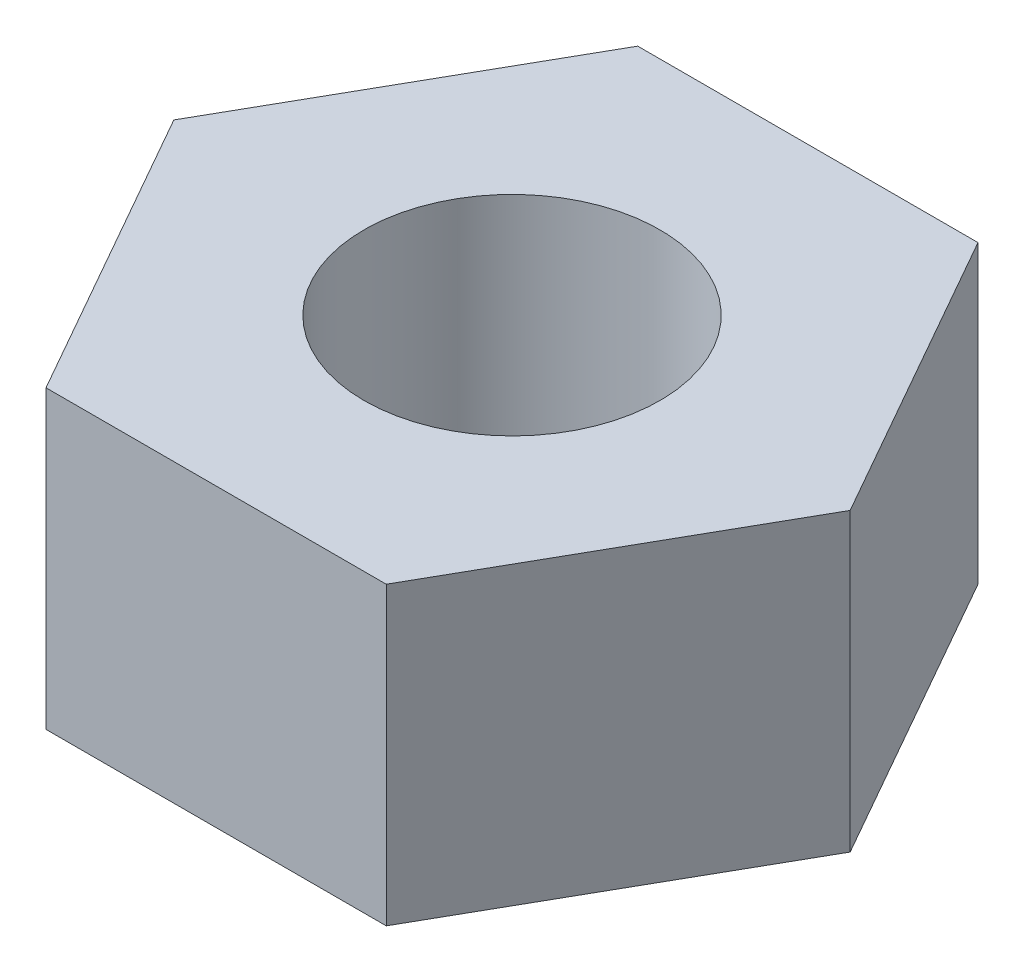
ISO-10303-21;
HEADER;
FILE_DESCRIPTION(('STEP AP214'),'2;1');
FILE_NAME('part.step','',(''),(''),'','','');
FILE_SCHEMA(('AUTOMOTIVE_DESIGN { 1 0 10303 214 1 1 1 1 }'));
ENDSEC;
DATA;
#1=APPLICATION_CONTEXT('core data for automotive mechanical design processes');
#2=APPLICATION_PROTOCOL_DEFINITION('international standard','automotive_design',2000,#1);
#3=PRODUCT_CONTEXT('',#1,'mechanical');
#4=PRODUCT('Part','Part','',(#3));
#5=PRODUCT_RELATED_PRODUCT_CATEGORY('part','',(#4));
#6=PRODUCT_DEFINITION_FORMATION('','',#4);
#7=PRODUCT_DEFINITION_CONTEXT('part definition',#1,'design');
#8=PRODUCT_DEFINITION('design','',#6,#7);
#9=PRODUCT_DEFINITION_SHAPE('','',#8);
#10=(LENGTH_UNIT() NAMED_UNIT(*) SI_UNIT(.MILLI.,.METRE.));
#11=(NAMED_UNIT(*) PLANE_ANGLE_UNIT() SI_UNIT($,.RADIAN.));
#12=(NAMED_UNIT(*) SI_UNIT($,.STERADIAN.) SOLID_ANGLE_UNIT());
#13=UNCERTAINTY_MEASURE_WITH_UNIT(LENGTH_MEASURE(1.E-05),#10,'distance_accuracy_value','');
#14=(GEOMETRIC_REPRESENTATION_CONTEXT(3) GLOBAL_UNCERTAINTY_ASSIGNED_CONTEXT((#13)) GLOBAL_UNIT_ASSIGNED_CONTEXT((#10,
#11,#12)) REPRESENTATION_CONTEXT('',''));
#15=CARTESIAN_POINT('',(0.,0.,0.));
#16=DIRECTION('',(0.,0.,1.));
#17=DIRECTION('',(1.,0.,0.));
#18=AXIS2_PLACEMENT_3D('',#15,#16,#17);
#19=CARTESIAN_POINT('',(0.,10.,0.));
#20=DIRECTION('',(0.,-1.,0.));
#21=DIRECTION('',(0.,0.,-1.));
#22=AXIS2_PLACEMENT_3D('',#19,#20,#21);
#23=PLANE('',#22);
#24=DIRECTION('',(-0.493818117026111,0.,0.869565217391304));
#25=VECTOR('',#24,1.);
#26=CARTESIAN_POINT('',(-11.4289083458003,10.,0.));
#27=LINE('',#26,#25);
#28=CARTESIAN_POINT('',(-5.75,10.,-10.));
#29=VERTEX_POINT('',#28);
#30=CARTESIAN_POINT('',(-11.4289083458003,10.,0.));
#31=VERTEX_POINT('',#30);
#32=EDGE_CURVE('E150',#29,#31,#27,.T.);
#33=ORIENTED_EDGE('',*,*,#32,.T.);
#34=DIRECTION('',(0.493818117026111,0.,0.869565217391304));
#35=VECTOR('',#34,1.);
#36=CARTESIAN_POINT('',(-5.75,10.,10.));
#37=LINE('',#36,#35);
#38=CARTESIAN_POINT('',(-5.75,10.,10.));
#39=VERTEX_POINT('',#38);
#40=EDGE_CURVE('E98',#31,#39,#37,.T.);
#41=ORIENTED_EDGE('',*,*,#40,.T.);
#42=DIRECTION('',(1.,0.,0.));
#43=VECTOR('',#42,1.);
#44=CARTESIAN_POINT('',(5.75,10.,10.));
#45=LINE('',#44,#43);
#46=CARTESIAN_POINT('',(5.75,10.,10.));
#47=VERTEX_POINT('',#46);
#48=EDGE_CURVE('E111',#39,#47,#45,.T.);
#49=ORIENTED_EDGE('',*,*,#48,.T.);
#50=DIRECTION('',(0.493818117026111,0.,-0.869565217391304));
#51=VECTOR('',#50,1.);
#52=CARTESIAN_POINT('',(11.4289083458003,10.,0.));
#53=LINE('',#52,#51);
#54=CARTESIAN_POINT('',(11.4289083458003,10.,0.));
#55=VERTEX_POINT('',#54);
#56=EDGE_CURVE('E105',#47,#55,#53,.T.);
#57=ORIENTED_EDGE('',*,*,#56,.T.);
#58=DIRECTION('',(-0.493818117026111,0.,-0.869565217391304));
#59=VECTOR('',#58,1.);
#60=CARTESIAN_POINT('',(5.75,10.,-10.));
#61=LINE('',#60,#59);
#62=CARTESIAN_POINT('',(5.75,10.,-10.));
#63=VERTEX_POINT('',#62);
#64=EDGE_CURVE('E109',#55,#63,#61,.T.);
#65=ORIENTED_EDGE('',*,*,#64,.T.);
#66=DIRECTION('',(-1.,0.,0.));
#67=VECTOR('',#66,1.);
#68=CARTESIAN_POINT('',(-5.75,10.,-10.));
#69=LINE('',#68,#67);
#70=EDGE_CURVE('E61',#63,#29,#69,.T.);
#71=ORIENTED_EDGE('',*,*,#70,.T.);
#72=EDGE_LOOP('',(#33,#41,#49,#57,#65,#71));
#73=FACE_BOUND('',#72,.T.);
#74=CARTESIAN_POINT('',(0.,10.,0.));
#75=DIRECTION('',(0.,1.,0.));
#76=DIRECTION('',(0.,0.,1.));
#77=AXIS2_PLACEMENT_3D('',#74,#75,#76);
#78=CIRCLE('',#77,5.);
#79=CARTESIAN_POINT('',(0.,10.,5.));
#80=VERTEX_POINT('',#79);
#81=EDGE_CURVE('E138',#80,#80,#78,.T.);
#82=ORIENTED_EDGE('',*,*,#81,.F.);
#83=EDGE_LOOP('',(#82));
#84=FACE_BOUND('',#83,.T.);
#85=ADVANCED_FACE('F43',(#73,#84),#23,.F.);
#86=CARTESIAN_POINT('',(0.,0.,0.));
#87=DIRECTION('',(0.,-1.,0.));
#88=DIRECTION('',(0.,0.,-1.));
#89=AXIS2_PLACEMENT_3D('',#86,#87,#88);
#90=PLANE('',#89);
#91=DIRECTION('',(-0.493818117026111,0.,0.869565217391304));
#92=VECTOR('',#91,1.);
#93=CARTESIAN_POINT('',(-11.4289083458003,0.,0.));
#94=LINE('',#93,#92);
#95=CARTESIAN_POINT('',(-5.75,0.,-10.));
#96=VERTEX_POINT('',#95);
#97=CARTESIAN_POINT('',(-11.4289083458003,0.,0.));
#98=VERTEX_POINT('',#97);
#99=EDGE_CURVE('E133',#96,#98,#94,.T.);
#100=ORIENTED_EDGE('',*,*,#99,.F.);
#101=DIRECTION('',(-1.,0.,0.));
#102=VECTOR('',#101,1.);
#103=CARTESIAN_POINT('',(-5.75,0.,-10.));
#104=LINE('',#103,#102);
#105=CARTESIAN_POINT('',(5.75,0.,-10.));
#106=VERTEX_POINT('',#105);
#107=EDGE_CURVE('E90',#106,#96,#104,.T.);
#108=ORIENTED_EDGE('',*,*,#107,.F.);
#109=DIRECTION('',(-0.493818117026111,0.,-0.869565217391304));
#110=VECTOR('',#109,1.);
#111=CARTESIAN_POINT('',(5.75,0.,-10.));
#112=LINE('',#111,#110);
#113=CARTESIAN_POINT('',(11.4289083458003,0.,0.));
#114=VERTEX_POINT('',#113);
#115=EDGE_CURVE('E84',#114,#106,#112,.T.);
#116=ORIENTED_EDGE('',*,*,#115,.F.);
#117=DIRECTION('',(0.493818117026111,0.,-0.869565217391304));
#118=VECTOR('',#117,1.);
#119=CARTESIAN_POINT('',(11.4289083458003,0.,0.));
#120=LINE('',#119,#118);
#121=CARTESIAN_POINT('',(5.75,0.,10.));
#122=VERTEX_POINT('',#121);
#123=EDGE_CURVE('E120',#122,#114,#120,.T.);
#124=ORIENTED_EDGE('',*,*,#123,.F.);
#125=DIRECTION('',(1.,0.,0.));
#126=VECTOR('',#125,1.);
#127=CARTESIAN_POINT('',(5.75,0.,10.));
#128=LINE('',#127,#126);
#129=CARTESIAN_POINT('',(-5.75,0.,10.));
#130=VERTEX_POINT('',#129);
#131=EDGE_CURVE('E141',#130,#122,#128,.T.);
#132=ORIENTED_EDGE('',*,*,#131,.F.);
#133=DIRECTION('',(0.493818117026111,0.,0.869565217391304));
#134=VECTOR('',#133,1.);
#135=CARTESIAN_POINT('',(-5.75,0.,10.));
#136=LINE('',#135,#134);
#137=EDGE_CURVE('E137',#98,#130,#136,.T.);
#138=ORIENTED_EDGE('',*,*,#137,.F.);
#139=EDGE_LOOP('',(#100,#108,#116,#124,#132,#138));
#140=FACE_BOUND('',#139,.T.);
#141=CARTESIAN_POINT('',(0.,0.,0.));
#142=DIRECTION('',(0.,1.,0.));
#143=DIRECTION('',(0.,0.,1.));
#144=AXIS2_PLACEMENT_3D('',#141,#142,#143);
#145=CIRCLE('',#144,5.);
#146=CARTESIAN_POINT('',(0.,0.,5.));
#147=VERTEX_POINT('',#146);
#148=EDGE_CURVE('E265',#147,#147,#145,.T.);
#149=ORIENTED_EDGE('',*,*,#148,.T.);
#150=EDGE_LOOP('',(#149));
#151=FACE_BOUND('',#150,.T.);
#152=ADVANCED_FACE('F163',(#140,#151),#90,.T.);
#153=CARTESIAN_POINT('',(-11.4289083458003,10.,0.));
#154=DIRECTION('',(0.869565217391304,0.,0.493818117026111));
#155=DIRECTION('',(0.493818117026111,0.,-0.869565217391304));
#156=AXIS2_PLACEMENT_3D('',#153,#154,#155);
#157=PLANE('',#156);
#158=ORIENTED_EDGE('',*,*,#99,.T.);
#159=DIRECTION('',(0.,-1.,0.));
#160=VECTOR('',#159,1.);
#161=CARTESIAN_POINT('',(-11.4289083458003,10.,0.));
#162=LINE('',#161,#160);
#163=EDGE_CURVE('E11',#31,#98,#162,.T.);
#164=ORIENTED_EDGE('',*,*,#163,.F.);
#165=ORIENTED_EDGE('',*,*,#32,.F.);
#166=DIRECTION('',(0.,-1.,0.));
#167=VECTOR('',#166,1.);
#168=CARTESIAN_POINT('',(-5.75,10.,-10.));
#169=LINE('',#168,#167);
#170=EDGE_CURVE('E129',#29,#96,#169,.T.);
#171=ORIENTED_EDGE('',*,*,#170,.T.);
#172=EDGE_LOOP('',(#158,#164,#165,#171));
#173=FACE_BOUND('',#172,.T.);
#174=ADVANCED_FACE('F45',(#173),#157,.F.);
#175=CARTESIAN_POINT('',(-5.75,10.,10.));
#176=DIRECTION('',(0.869565217391304,0.,-0.493818117026111));
#177=DIRECTION('',(-0.493818117026111,0.,-0.869565217391304));
#178=AXIS2_PLACEMENT_3D('',#175,#176,#177);
#179=PLANE('',#178);
#180=ORIENTED_EDGE('',*,*,#137,.T.);
#181=DIRECTION('',(0.,-1.,0.));
#182=VECTOR('',#181,1.);
#183=CARTESIAN_POINT('',(-5.75,10.,10.));
#184=LINE('',#183,#182);
#185=EDGE_CURVE('E53',#39,#130,#184,.T.);
#186=ORIENTED_EDGE('',*,*,#185,.F.);
#187=ORIENTED_EDGE('',*,*,#40,.F.);
#188=ORIENTED_EDGE('',*,*,#163,.T.);
#189=EDGE_LOOP('',(#180,#186,#187,#188));
#190=FACE_BOUND('',#189,.T.);
#191=ADVANCED_FACE('F188',(#190),#179,.F.);
#192=CARTESIAN_POINT('',(5.75,10.,10.));
#193=DIRECTION('',(0.,0.,-1.));
#194=DIRECTION('',(-1.,0.,0.));
#195=AXIS2_PLACEMENT_3D('',#192,#193,#194);
#196=PLANE('',#195);
#197=ORIENTED_EDGE('',*,*,#131,.T.);
#198=DIRECTION('',(0.,-1.,0.));
#199=VECTOR('',#198,1.);
#200=CARTESIAN_POINT('',(5.75,10.,10.));
#201=LINE('',#200,#199);
#202=EDGE_CURVE('E122',#47,#122,#201,.T.);
#203=ORIENTED_EDGE('',*,*,#202,.F.);
#204=ORIENTED_EDGE('',*,*,#48,.F.);
#205=ORIENTED_EDGE('',*,*,#185,.T.);
#206=EDGE_LOOP('',(#197,#203,#204,#205));
#207=FACE_BOUND('',#206,.T.);
#208=ADVANCED_FACE('F160',(#207),#196,.F.);
#209=CARTESIAN_POINT('',(11.4289083458003,10.,0.));
#210=DIRECTION('',(-0.869565217391304,0.,-0.493818117026111));
#211=DIRECTION('',(-0.493818117026111,0.,0.869565217391304));
#212=AXIS2_PLACEMENT_3D('',#209,#210,#211);
#213=PLANE('',#212);
#214=ORIENTED_EDGE('',*,*,#123,.T.);
#215=DIRECTION('',(0.,-1.,0.));
#216=VECTOR('',#215,1.);
#217=CARTESIAN_POINT('',(11.4289083458003,10.,0.));
#218=LINE('',#217,#216);
#219=EDGE_CURVE('E117',#55,#114,#218,.T.);
#220=ORIENTED_EDGE('',*,*,#219,.F.);
#221=ORIENTED_EDGE('',*,*,#56,.F.);
#222=ORIENTED_EDGE('',*,*,#202,.T.);
#223=EDGE_LOOP('',(#214,#220,#221,#222));
#224=FACE_BOUND('',#223,.T.);
#225=ADVANCED_FACE('F118',(#224),#213,.F.);
#226=CARTESIAN_POINT('',(5.75,10.,-10.));
#227=DIRECTION('',(-0.869565217391304,0.,0.493818117026111));
#228=DIRECTION('',(0.493818117026111,0.,0.869565217391304));
#229=AXIS2_PLACEMENT_3D('',#226,#227,#228);
#230=PLANE('',#229);
#231=ORIENTED_EDGE('',*,*,#115,.T.);
#232=DIRECTION('',(0.,-1.,0.));
#233=VECTOR('',#232,1.);
#234=CARTESIAN_POINT('',(5.75,10.,-10.));
#235=LINE('',#234,#233);
#236=EDGE_CURVE('E123',#63,#106,#235,.T.);
#237=ORIENTED_EDGE('',*,*,#236,.F.);
#238=ORIENTED_EDGE('',*,*,#64,.F.);
#239=ORIENTED_EDGE('',*,*,#219,.T.);
#240=EDGE_LOOP('',(#231,#237,#238,#239));
#241=FACE_BOUND('',#240,.T.);
#242=ADVANCED_FACE('F125',(#241),#230,.F.);
#243=CARTESIAN_POINT('',(-5.75,10.,-10.));
#244=DIRECTION('',(0.,0.,1.));
#245=DIRECTION('',(1.,0.,0.));
#246=AXIS2_PLACEMENT_3D('',#243,#244,#245);
#247=PLANE('',#246);
#248=ORIENTED_EDGE('',*,*,#107,.T.);
#249=ORIENTED_EDGE('',*,*,#170,.F.);
#250=ORIENTED_EDGE('',*,*,#70,.F.);
#251=ORIENTED_EDGE('',*,*,#236,.T.);
#252=EDGE_LOOP('',(#248,#249,#250,#251));
#253=FACE_BOUND('',#252,.T.);
#254=ADVANCED_FACE('F168',(#253),#247,.F.);
#255=CARTESIAN_POINT('',(0.,10.,0.));
#256=DIRECTION('',(0.,-1.,0.));
#257=DIRECTION('',(0.,0.,-1.));
#258=AXIS2_PLACEMENT_3D('',#255,#256,#257);
#259=CYLINDRICAL_SURFACE('',#258,5.);
#260=ORIENTED_EDGE('',*,*,#81,.T.);
#261=EDGE_LOOP('',(#260));
#262=FACE_BOUND('',#261,.T.);
#263=ORIENTED_EDGE('',*,*,#148,.F.);
#264=EDGE_LOOP('',(#263));
#265=FACE_BOUND('',#264,.T.);
#266=ADVANCED_FACE('F170',(#262,#265),#259,.F.);
#267=CLOSED_SHELL('',(#85,#152,#174,#191,#208,#225,#242,#254,#266));
#268=MANIFOLD_SOLID_BREP('B2',#267);
#269=ADVANCED_BREP_SHAPE_REPRESENTATION('',(#18,#268),#14);
#270=SHAPE_DEFINITION_REPRESENTATION(#9,#269);
ENDSEC;
END-ISO-10303-21;
